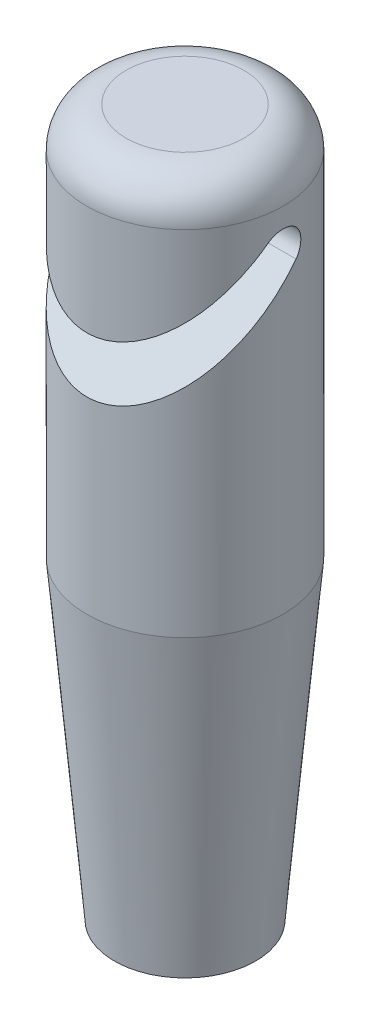
ISO-10303-21;
HEADER;
FILE_DESCRIPTION(('STEP AP214'),'2;1');
FILE_NAME('part.step','',(''),(''),'','','');
FILE_SCHEMA(('AUTOMOTIVE_DESIGN { 1 0 10303 214 1 1 1 1 }'));
ENDSEC;
DATA;
#1=APPLICATION_CONTEXT('core data for automotive mechanical design processes');
#2=APPLICATION_PROTOCOL_DEFINITION('international standard','automotive_design',2000,#1);
#3=PRODUCT_CONTEXT('',#1,'mechanical');
#4=PRODUCT('Part','Part','',(#3));
#5=PRODUCT_RELATED_PRODUCT_CATEGORY('part','',(#4));
#6=PRODUCT_DEFINITION_FORMATION('','',#4);
#7=PRODUCT_DEFINITION_CONTEXT('part definition',#1,'design');
#8=PRODUCT_DEFINITION('design','',#6,#7);
#9=PRODUCT_DEFINITION_SHAPE('','',#8);
#10=(LENGTH_UNIT() NAMED_UNIT(*) SI_UNIT(.MILLI.,.METRE.));
#11=(NAMED_UNIT(*) PLANE_ANGLE_UNIT() SI_UNIT($,.RADIAN.));
#12=(NAMED_UNIT(*) SI_UNIT($,.STERADIAN.) SOLID_ANGLE_UNIT());
#13=UNCERTAINTY_MEASURE_WITH_UNIT(LENGTH_MEASURE(1.E-05),#10,'distance_accuracy_value','');
#14=(GEOMETRIC_REPRESENTATION_CONTEXT(3) GLOBAL_UNCERTAINTY_ASSIGNED_CONTEXT((#13)) GLOBAL_UNIT_ASSIGNED_CONTEXT((#10,
#11,#12)) REPRESENTATION_CONTEXT('',''));
#15=CARTESIAN_POINT('',(0.,0.,0.));
#16=DIRECTION('',(0.,0.,1.));
#17=DIRECTION('',(1.,0.,0.));
#18=AXIS2_PLACEMENT_3D('',#15,#16,#17);
#19=CARTESIAN_POINT('',(0.,10.,0.));
#20=DIRECTION('',(0.,-1.,0.));
#21=DIRECTION('',(0.,0.,-1.));
#22=AXIS2_PLACEMENT_3D('',#19,#20,#21);
#23=CYLINDRICAL_SURFACE('',#22,2.5);
#24=CARTESIAN_POINT('',(0.,8.70710678118655,0.));
#25=DIRECTION('',(0.,0.707106781186546,0.707106781186549));
#26=DIRECTION('',(0.,-0.707106781186549,0.707106781186546));
#27=AXIS2_PLACEMENT_3D('',#24,#25,#26);
#28=ELLIPSE('',#27,3.53553390593274,2.5);
#29=CARTESIAN_POINT('',(-2.47487373415292,8.35355339059327,0.353553390593275));
#30=VERTEX_POINT('',#29);
#31=CARTESIAN_POINT('',(2.47487373415292,8.35355339059327,0.353553390593275));
#32=VERTEX_POINT('',#31);
#33=EDGE_CURVE('E13',#30,#32,#28,.T.);
#34=ORIENTED_EDGE('',*,*,#33,.T.);
#35=CARTESIAN_POINT('',(2.47487373415292,8.35355339059327,0.353553390593275));
#36=CARTESIAN_POINT('',(2.47771027036293,8.37338204902177,0.333754757866904));
#37=CARTESIAN_POINT('',(2.48053107747199,8.39151604997042,0.312261119154381));
#38=CARTESIAN_POINT('',(2.48585661915904,8.42396341250682,0.266524891221633));
#39=CARTESIAN_POINT('',(2.4883613406358,8.43827661575629,0.242282188136298));
#40=CARTESIAN_POINT('',(2.49277170227756,8.46265978061835,0.191668975647269));
#41=CARTESIAN_POINT('',(2.49467682752653,8.47272609763887,0.165296661681224));
#42=CARTESIAN_POINT('',(2.49767201625169,8.48828741727117,0.111204739629704));
#43=CARTESIAN_POINT('',(2.49876250378062,8.49378479837169,0.0834858405122793));
#44=CARTESIAN_POINT('',(2.49999776248923,8.49999797510688,0.0278511360515192));
#45=CARTESIAN_POINT('',(2.5001542978638,8.50077325363059,-5.77668398437568E-05));
#46=CARTESIAN_POINT('',(2.49953579481515,8.49767605545732,-0.055610690883896));
#47=CARTESIAN_POINT('',(2.49876060009315,8.49380279896348,-0.0832546668105833));
#48=CARTESIAN_POINT('',(2.49637455889237,8.48158187718763,-0.137255612191242));
#49=CARTESIAN_POINT('',(2.49477062488468,8.47327120530156,-0.163621284178567));
#50=CARTESIAN_POINT('',(2.49090491841998,8.45245047152618,-0.21458418518126));
#51=CARTESIAN_POINT('',(2.48864314519804,8.43994040475385,-0.239181412140248));
#52=CARTESIAN_POINT('',(2.48367129456718,8.41088913431575,-0.286260517766251));
#53=CARTESIAN_POINT('',(2.480955806566,8.39429797417101,-0.308710988061795));
#54=CARTESIAN_POINT('',(2.47539270214798,8.35762658282829,-0.350538176232683));
#55=CARTESIAN_POINT('',(2.47254506861751,8.33754589878689,-0.369914494543265));
#56=CARTESIAN_POINT('',(2.46698834554049,8.29411098659621,-0.405333687151271));
#57=CARTESIAN_POINT('',(2.46428191512004,8.27071288991032,-0.421323246662098));
#58=CARTESIAN_POINT('',(2.45936386627856,8.22151447640729,-0.449143421201267));
#59=CARTESIAN_POINT('',(2.45715222199992,8.19571428522377,-0.460974253583714));
#60=CARTESIAN_POINT('',(2.45349506187892,8.14260033596708,-0.480058821591376));
#61=CARTESIAN_POINT('',(2.45204490818377,8.11529688647773,-0.48734031774095));
#62=CARTESIAN_POINT('',(2.4500635431732,8.05982383108507,-0.497206651357653));
#63=CARTESIAN_POINT('',(2.449532180081,8.0316543690227,-0.499792264550319));
#64=CARTESIAN_POINT('',(2.4494529428183,7.97579437559574,-0.500180120947734));
#65=CARTESIAN_POINT('',(2.44988740094256,7.94810442702414,-0.498068293713123));
#66=CARTESIAN_POINT('',(2.45165283551995,7.89347622631312,-0.489303627399419));
#67=CARTESIAN_POINT('',(2.45298403139784,7.86653815983393,-0.482649676892769));
#68=CARTESIAN_POINT('',(2.45638748111546,7.81419917995494,-0.465016590035614));
#69=CARTESIAN_POINT('',(2.45845902139142,7.78879681387396,-0.454041617370342));
#70=CARTESIAN_POINT('',(2.46310932422416,7.74020958045525,-0.428095008749576));
#71=CARTESIAN_POINT('',(2.46568751744009,7.71702226706812,-0.413127852244581));
#72=CARTESIAN_POINT('',(2.47049678709488,7.678053080059,-0.383174956974145));
#73=CARTESIAN_POINT('',(2.4726856830612,7.66174304239058,-0.368864944866316));
#74=CARTESIAN_POINT('',(2.47487373415291,7.64644660940669,-0.353553390593324));
#75=B_SPLINE_CURVE_WITH_KNOTS('',3,(#35,#36,#37,#38,#39,#40,#41,#42,#43,#44,#45,#46,#47,#48,#49,
#50,#51,#52,#53,#54,#55,#56,#57,#58,#59,#60,#61,#62,#63,#64,#65,#66,#67,#68,#69,#70,#71,#72,#73,
#74),.UNSPECIFIED.,.F.,.F.,(4,2,2,2,2,2,2,2,2,2,2,2,2,2,2,2,2,2,2,4),(0.,0.084390999120015,
0.168785494957954,0.253252269847526,0.337675045578501,0.421032136444135,0.504403212507982,
0.587089859318516,0.669776602277048,0.753530820623438,0.837295916072512,0.92229506490366,
1.00728977062966,1.09176063015321,1.17621753443861,1.25914220948593,1.34208718293039,
1.42495242643537,1.50772507887711,1.572961594018),.UNSPECIFIED.);
#76=CARTESIAN_POINT('',(2.47487373415292,7.64644660940673,-0.353553390593275));
#77=VERTEX_POINT('',#76);
#78=EDGE_CURVE('E59',#32,#77,#75,.T.);
#79=ORIENTED_EDGE('',*,*,#78,.T.);
#80=CARTESIAN_POINT('',(0.,7.29289321881345,0.));
#81=DIRECTION('',(0.,-0.707106781186546,-0.707106781186549));
#82=DIRECTION('',(0.,-0.707106781186549,0.707106781186546));
#83=AXIS2_PLACEMENT_3D('',#80,#81,#82);
#84=ELLIPSE('',#83,3.53553390593274,2.5);
#85=CARTESIAN_POINT('',(-2.47487373415292,7.64644660940673,-0.353553390593275));
#86=VERTEX_POINT('',#85);
#87=EDGE_CURVE('E82',#77,#86,#84,.T.);
#88=ORIENTED_EDGE('',*,*,#87,.T.);
#89=CARTESIAN_POINT('',(-2.47487373415292,7.64644660940673,-0.353553390593274));
#90=CARTESIAN_POINT('',(-2.47203780385218,7.66624973309455,-0.373386308102536));
#91=CARTESIAN_POINT('',(-2.46920553047424,7.68774741638365,-0.391523108258386));
#92=CARTESIAN_POINT('',(-2.46384255173679,7.73349237429543,-0.423974665642466));
#93=CARTESIAN_POINT('',(-2.46131186970588,7.75773986133738,-0.438289127312393));
#94=CARTESIAN_POINT('',(-2.45684494201614,7.80836334519785,-0.462673455412689));
#95=CARTESIAN_POINT('',(-2.45490920820085,7.83474115026783,-0.472739669769502));
#96=CARTESIAN_POINT('',(-2.45186208965846,7.88884511531166,-0.488299064221456));
#97=CARTESIAN_POINT('',(-2.45075026289274,7.91657054374406,-0.493794696696904));
#98=CARTESIAN_POINT('',(-2.44949158591231,7.97220756498396,-0.500000967531288));
#99=CARTESIAN_POINT('',(-2.44933235867677,8.00011203244683,-0.500772982347714));
#100=CARTESIAN_POINT('',(-2.44996452886307,8.05565526467642,-0.497670811050436));
#101=CARTESIAN_POINT('',(-2.4507560867292,8.08329398380487,-0.493795840761596));
#102=CARTESIAN_POINT('',(-2.45318596992433,8.13726833879878,-0.481577071644225));
#103=CARTESIAN_POINT('',(-2.4548168194422,8.1636132662572,-0.47327270332973));
#104=CARTESIAN_POINT('',(-2.4587356406686,8.2145372026902,-0.452471442122568));
#105=CARTESIAN_POINT('',(-2.46102361798161,8.23911619660129,-0.439974513472356));
#106=CARTESIAN_POINT('',(-2.46603828894579,8.28618291631934,-0.410943217142049));
#107=CARTESIAN_POINT('',(-2.46877057308436,8.3086373086169,-0.394355788697777));
#108=CARTESIAN_POINT('',(-2.47434864598098,8.35047392162459,-0.357689679480519));
#109=CARTESIAN_POINT('',(-2.47719444888674,8.3698557578991,-0.337610562488425));
#110=CARTESIAN_POINT('',(-2.48272970030752,8.40528787700064,-0.294174615085707));
#111=CARTESIAN_POINT('',(-2.4854162121134,8.42128461848548,-0.270773680236628));
#112=CARTESIAN_POINT('',(-2.49028474849272,8.44911761560386,-0.221567614909557));
#113=CARTESIAN_POINT('',(-2.49246680008541,8.46095409408176,-0.195762613299034));
#114=CARTESIAN_POINT('',(-2.49606764526143,8.48004320106227,-0.14265152171813));
#115=CARTESIAN_POINT('',(-2.49749140438033,8.48732570653252,-0.115356520910181));
#116=CARTESIAN_POINT('',(-2.49943612405128,8.49719688040664,-0.0599012203688633));
#117=CARTESIAN_POINT('',(-2.49995722463934,8.49978627688964,-0.0317410555447007));
#118=CARTESIAN_POINT('',(-2.50003699497941,8.5001848235669,0.0241231576873861));
#119=CARTESIAN_POINT('',(-2.49961222699343,8.49807623562226,0.0518266312988154));
#120=CARTESIAN_POINT('',(-2.49788096259698,8.48931334296302,0.106482623314923));
#121=CARTESIAN_POINT('',(-2.49657425569581,8.48265795306713,0.133434960847949));
#122=CARTESIAN_POINT('',(-2.49322397089731,8.46501622261693,0.185804222846367));
#123=CARTESIAN_POINT('',(-2.49118104315342,8.45403370253656,0.211222479002491));
#124=CARTESIAN_POINT('',(-2.48657968080495,8.4280670989005,0.259838217571321));
#125=CARTESIAN_POINT('',(-2.48402182571985,8.41308750769169,0.283038153656499));
#126=CARTESIAN_POINT('',(-2.47923892313252,8.38313545080592,0.321992012850989));
#127=CARTESIAN_POINT('',(-2.47705932747149,8.36884353919822,0.338278434597201));
#128=CARTESIAN_POINT('',(-2.47487373415292,8.35355339059328,0.35355339059328));
#129=B_SPLINE_CURVE_WITH_KNOTS('',3,(#89,#90,#91,#92,#93,#94,#95,#96,#97,#98,#99,#100,#101,#102,
#103,#104,#105,#106,#107,#108,#109,#110,#111,#112,#113,#114,#115,#116,#117,#118,#119,#120,#121,
#122,#123,#124,#125,#126,#127,#128),.UNSPECIFIED.,.F.,.F.,(4,2,2,2,2,2,2,2,2,2,2,2,2,2,2,2,2,2,
2,4),(0.,0.0844091029727874,0.168824730901882,0.253312780974816,0.337755469044856,
0.421098577682141,0.504455752383651,0.58708297142568,0.66971089519736,0.753472910264814,
0.837245397307501,0.922257480199353,1.0072650087271,1.09170881565026,1.17613952101582,
1.25910348055779,1.34208724795739,1.42499791161193,1.50781578082311,1.57296147530652),.UNSPECIFIED.);
#130=EDGE_CURVE('E76',#86,#30,#129,.T.);
#131=ORIENTED_EDGE('',*,*,#130,.T.);
#132=EDGE_LOOP('',(#34,#79,#88,#131));
#133=FACE_BOUND('',#132,.T.);
#134=CARTESIAN_POINT('',(0.,9.,0.));
#135=DIRECTION('',(0.,1.,0.));
#136=DIRECTION('',(0.,0.,1.));
#137=AXIS2_PLACEMENT_3D('',#134,#135,#136);
#138=CIRCLE('',#137,2.5);
#139=CARTESIAN_POINT('',(0.,9.,2.5));
#140=VERTEX_POINT('',#139);
#141=EDGE_CURVE('E87',#140,#140,#138,.F.);
#142=ORIENTED_EDGE('',*,*,#141,.T.);
#143=EDGE_LOOP('',(#142));
#144=FACE_BOUND('',#143,.T.);
#145=CARTESIAN_POINT('',(0.,0.,0.));
#146=DIRECTION('',(0.,-1.,0.));
#147=DIRECTION('',(0.,0.,-1.));
#148=AXIS2_PLACEMENT_3D('',#145,#146,#147);
#149=CIRCLE('',#148,2.5);
#150=CARTESIAN_POINT('',(0.,0.,-2.5));
#151=VERTEX_POINT('',#150);
#152=EDGE_CURVE('E109',#151,#151,#149,.T.);
#153=ORIENTED_EDGE('',*,*,#152,.F.);
#154=EDGE_LOOP('',(#153));
#155=FACE_BOUND('',#154,.T.);
#156=ADVANCED_FACE('F50',(#133,#144,#155),#23,.T.);
#157=CARTESIAN_POINT('',(0.,10.,0.));
#158=DIRECTION('',(0.,1.,0.));
#159=DIRECTION('',(0.,0.,1.));
#160=AXIS2_PLACEMENT_3D('',#157,#158,#159);
#161=PLANE('',#160);
#162=CARTESIAN_POINT('',(0.,10.,0.));
#163=DIRECTION('',(0.,1.,0.));
#164=DIRECTION('',(0.,0.,1.));
#165=AXIS2_PLACEMENT_3D('',#162,#163,#164);
#166=CIRCLE('',#165,1.5);
#167=CARTESIAN_POINT('',(0.,10.,1.5));
#168=VERTEX_POINT('',#167);
#169=EDGE_CURVE('E117',#168,#168,#166,.T.);
#170=ORIENTED_EDGE('',*,*,#169,.T.);
#171=EDGE_LOOP('',(#170));
#172=FACE_BOUND('',#171,.T.);
#173=ADVANCED_FACE('F156',(#172),#161,.T.);
#174=CARTESIAN_POINT('',(0.,0.,0.));
#175=DIRECTION('',(0.,1.,0.));
#176=DIRECTION('',(0.,0.,-1.));
#177=AXIS2_PLACEMENT_3D('',#174,#175,#176);
#178=CONICAL_SURFACE('',#177,2.5,0.0872664625997165);
#179=CARTESIAN_POINT('',(0.,-8.,0.));
#180=DIRECTION('',(0.,-1.,0.));
#181=DIRECTION('',(0.,0.,-1.));
#182=AXIS2_PLACEMENT_3D('',#179,#180,#181);
#183=CIRCLE('',#182,1.80009069179261);
#184=CARTESIAN_POINT('',(0.,-8.,-1.80009069179261));
#185=VERTEX_POINT('',#184);
#186=EDGE_CURVE('E113',#185,#185,#183,.T.);
#187=ORIENTED_EDGE('',*,*,#186,.F.);
#188=EDGE_LOOP('',(#187));
#189=FACE_BOUND('',#188,.T.);
#190=ORIENTED_EDGE('',*,*,#152,.T.);
#191=EDGE_LOOP('',(#190));
#192=FACE_BOUND('',#191,.T.);
#193=ADVANCED_FACE('F153',(#189,#192),#178,.T.);
#194=CARTESIAN_POINT('',(0.,-8.,0.));
#195=DIRECTION('',(0.,-1.,0.));
#196=DIRECTION('',(0.,0.,-1.));
#197=AXIS2_PLACEMENT_3D('',#194,#195,#196);
#198=PLANE('',#197);
#199=CARTESIAN_POINT('',(0.,-8.,0.));
#200=DIRECTION('',(0.,-1.,0.));
#201=DIRECTION('',(0.,0.,-1.));
#202=AXIS2_PLACEMENT_3D('',#199,#200,#201);
#203=CIRCLE('',#202,1.5);
#204=CARTESIAN_POINT('',(0.,-8.,-1.5));
#205=VERTEX_POINT('',#204);
#206=EDGE_CURVE('E99',#205,#205,#203,.T.);
#207=ORIENTED_EDGE('',*,*,#206,.F.);
#208=EDGE_LOOP('',(#207));
#209=FACE_BOUND('',#208,.T.);
#210=ORIENTED_EDGE('',*,*,#186,.T.);
#211=EDGE_LOOP('',(#210));
#212=FACE_BOUND('',#211,.T.);
#213=ADVANCED_FACE('F149',(#209,#212),#198,.T.);
#214=CARTESIAN_POINT('',(0.,0.,0.));
#215=DIRECTION('',(0.,1.,0.));
#216=DIRECTION('',(0.,0.,1.));
#217=AXIS2_PLACEMENT_3D('',#214,#215,#216);
#218=PLANE('',#217);
#219=CARTESIAN_POINT('',(0.,0.,0.));
#220=DIRECTION('',(0.,1.,0.));
#221=DIRECTION('',(0.,0.,1.));
#222=AXIS2_PLACEMENT_3D('',#219,#220,#221);
#223=CIRCLE('',#222,1.5);
#224=CARTESIAN_POINT('',(0.,0.,1.5));
#225=VERTEX_POINT('',#224);
#226=EDGE_CURVE('E105',#225,#225,#223,.F.);
#227=ORIENTED_EDGE('',*,*,#226,.T.);
#228=EDGE_LOOP('',(#227));
#229=FACE_BOUND('',#228,.T.);
#230=ADVANCED_FACE('F145',(#229),#218,.F.);
#231=CARTESIAN_POINT('',(0.,4.24264068711928,0.));
#232=DIRECTION('',(0.,-1.,0.));
#233=DIRECTION('',(0.,0.,-1.));
#234=AXIS2_PLACEMENT_3D('',#231,#232,#233);
#235=CYLINDRICAL_SURFACE('',#234,1.5);
#236=ORIENTED_EDGE('',*,*,#206,.T.);
#237=EDGE_LOOP('',(#236));
#238=FACE_BOUND('',#237,.T.);
#239=ORIENTED_EDGE('',*,*,#226,.F.);
#240=EDGE_LOOP('',(#239));
#241=FACE_BOUND('',#240,.T.);
#242=ADVANCED_FACE('F142',(#238,#241),#235,.F.);
#243=CARTESIAN_POINT('',(0.,9.,0.));
#244=DIRECTION('',(0.,1.,0.));
#245=DIRECTION('',(0.,0.,1.));
#246=AXIS2_PLACEMENT_3D('',#243,#244,#245);
#247=TOROIDAL_SURFACE('',#246,1.5,1.);
#248=ORIENTED_EDGE('',*,*,#141,.F.);
#249=EDGE_LOOP('',(#248));
#250=FACE_BOUND('',#249,.T.);
#251=ORIENTED_EDGE('',*,*,#169,.F.);
#252=EDGE_LOOP('',(#251));
#253=FACE_BOUND('',#252,.T.);
#254=ADVANCED_FACE('F52',(#250,#253),#247,.T.);
#255=CARTESIAN_POINT('',(-2.5,2.28883180457995,6.41827497660657));
#256=DIRECTION('',(0.,0.707106781186546,0.707106781186549));
#257=DIRECTION('',(0.,-0.707106781186549,0.707106781186546));
#258=AXIS2_PLACEMENT_3D('',#255,#256,#257);
#259=PLANE('',#258);
#260=DIRECTION('',(1.,0.,0.));
#261=VECTOR('',#260,1.);
#262=CARTESIAN_POINT('',(-2.5,8.35355339059327,0.353553390593275));
#263=LINE('',#262,#261);
#264=EDGE_CURVE('E91',#30,#32,#263,.T.);
#265=ORIENTED_EDGE('',*,*,#264,.T.);
#266=ORIENTED_EDGE('',*,*,#33,.F.);
#267=EDGE_LOOP('',(#265,#266));
#268=FACE_BOUND('',#267,.T.);
#269=ADVANCED_FACE('F138',(#268),#259,.F.);
#270=CARTESIAN_POINT('',(-2.5,8.,0.));
#271=DIRECTION('',(1.,0.,0.));
#272=DIRECTION('',(0.,0.,-1.));
#273=AXIS2_PLACEMENT_3D('',#270,#271,#272);
#274=CYLINDRICAL_SURFACE('',#273,0.5);
#275=ORIENTED_EDGE('',*,*,#264,.F.);
#276=ORIENTED_EDGE('',*,*,#130,.F.);
#277=DIRECTION('',(1.,0.,0.));
#278=VECTOR('',#277,1.);
#279=CARTESIAN_POINT('',(-2.5,7.64644660940673,-0.353553390593275));
#280=LINE('',#279,#278);
#281=EDGE_CURVE('E90',#86,#77,#280,.T.);
#282=ORIENTED_EDGE('',*,*,#281,.T.);
#283=ORIENTED_EDGE('',*,*,#78,.F.);
#284=EDGE_LOOP('',(#275,#276,#282,#283));
#285=FACE_BOUND('',#284,.T.);
#286=ADVANCED_FACE('F89',(#285),#274,.F.);
#287=CARTESIAN_POINT('',(-2.5,7.64644660940673,-0.353553390593275));
#288=DIRECTION('',(0.,-0.707106781186546,-0.707106781186549));
#289=DIRECTION('',(0.,0.707106781186549,-0.707106781186546));
#290=AXIS2_PLACEMENT_3D('',#287,#288,#289);
#291=PLANE('',#290);
#292=ORIENTED_EDGE('',*,*,#87,.F.);
#293=ORIENTED_EDGE('',*,*,#281,.F.);
#294=EDGE_LOOP('',(#292,#293));
#295=FACE_BOUND('',#294,.T.);
#296=ADVANCED_FACE('F94',(#295),#291,.F.);
#297=CLOSED_SHELL('',(#156,#173,#193,#213,#230,#242,#254,#269,#286,#296));
#298=MANIFOLD_SOLID_BREP('B2',#297);
#299=ADVANCED_BREP_SHAPE_REPRESENTATION('',(#18,#298),#14);
#300=SHAPE_DEFINITION_REPRESENTATION(#9,#299);
ENDSEC;
END-ISO-10303-21;
